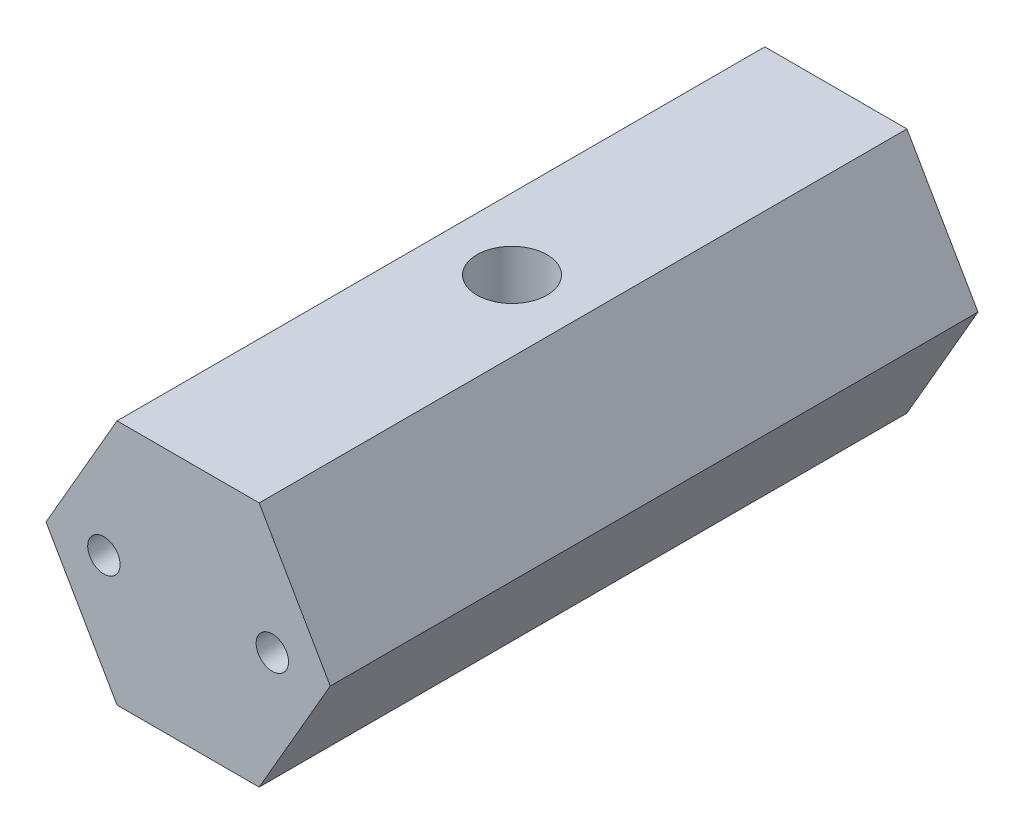
ISO-10303-21;
HEADER;
FILE_DESCRIPTION(('STEP AP214'),'2;1');
FILE_NAME('part.step','',(''),(''),'','','');
FILE_SCHEMA(('AUTOMOTIVE_DESIGN { 1 0 10303 214 1 1 1 1 }'));
ENDSEC;
DATA;
#1=APPLICATION_CONTEXT('core data for automotive mechanical design processes');
#2=APPLICATION_PROTOCOL_DEFINITION('international standard','automotive_design',2000,#1);
#3=PRODUCT_CONTEXT('',#1,'mechanical');
#4=PRODUCT('Part','Part','',(#3));
#5=PRODUCT_RELATED_PRODUCT_CATEGORY('part','',(#4));
#6=PRODUCT_DEFINITION_FORMATION('','',#4);
#7=PRODUCT_DEFINITION_CONTEXT('part definition',#1,'design');
#8=PRODUCT_DEFINITION('design','',#6,#7);
#9=PRODUCT_DEFINITION_SHAPE('','',#8);
#10=(LENGTH_UNIT() NAMED_UNIT(*) SI_UNIT(.MILLI.,.METRE.));
#11=(NAMED_UNIT(*) PLANE_ANGLE_UNIT() SI_UNIT($,.RADIAN.));
#12=(NAMED_UNIT(*) SI_UNIT($,.STERADIAN.) SOLID_ANGLE_UNIT());
#13=UNCERTAINTY_MEASURE_WITH_UNIT(LENGTH_MEASURE(1.E-05),#10,'distance_accuracy_value','');
#14=(GEOMETRIC_REPRESENTATION_CONTEXT(3) GLOBAL_UNCERTAINTY_ASSIGNED_CONTEXT((#13)) GLOBAL_UNIT_ASSIGNED_CONTEXT((#10,
#11,#12)) REPRESENTATION_CONTEXT('',''));
#15=CARTESIAN_POINT('',(0.,0.,0.));
#16=DIRECTION('',(0.,0.,1.));
#17=DIRECTION('',(1.,0.,0.));
#18=AXIS2_PLACEMENT_3D('',#15,#16,#17);
#19=CARTESIAN_POINT('',(5.48482755730145,9.5,25.));
#20=DIRECTION('',(0.,-1.,0.));
#21=DIRECTION('',(1.,0.,0.));
#22=AXIS2_PLACEMENT_3D('',#19,#20,#21);
#23=PLANE('',#22);
#24=DIRECTION('',(-1.,0.,0.));
#25=VECTOR('',#24,1.);
#26=CARTESIAN_POINT('',(5.48482755730145,9.5,-25.));
#27=LINE('',#26,#25);
#28=CARTESIAN_POINT('',(5.48482755730145,9.5,-25.));
#29=VERTEX_POINT('',#28);
#30=CARTESIAN_POINT('',(-5.48482755730144,9.5,-25.));
#31=VERTEX_POINT('',#30);
#32=EDGE_CURVE('E93',#29,#31,#27,.T.);
#33=ORIENTED_EDGE('',*,*,#32,.T.);
#34=DIRECTION('',(0.,0.,-1.));
#35=VECTOR('',#34,1.);
#36=CARTESIAN_POINT('',(-5.48482755730144,9.5,25.));
#37=LINE('',#36,#35);
#38=CARTESIAN_POINT('',(-5.48482755730144,9.5,25.));
#39=VERTEX_POINT('',#38);
#40=EDGE_CURVE('E131',#39,#31,#37,.T.);
#41=ORIENTED_EDGE('',*,*,#40,.F.);
#42=DIRECTION('',(-1.,0.,0.));
#43=VECTOR('',#42,1.);
#44=CARTESIAN_POINT('',(5.48482755730145,9.5,25.));
#45=LINE('',#44,#43);
#46=CARTESIAN_POINT('',(5.48482755730145,9.5,25.));
#47=VERTEX_POINT('',#46);
#48=EDGE_CURVE('E119',#47,#39,#45,.T.);
#49=ORIENTED_EDGE('',*,*,#48,.F.);
#50=DIRECTION('',(0.,0.,-1.));
#51=VECTOR('',#50,1.);
#52=CARTESIAN_POINT('',(5.48482755730145,9.5,25.));
#53=LINE('',#52,#51);
#54=EDGE_CURVE('E126',#47,#29,#53,.T.);
#55=ORIENTED_EDGE('',*,*,#54,.T.);
#56=EDGE_LOOP('',(#33,#41,#49,#55));
#57=FACE_BOUND('',#56,.T.);
#58=CARTESIAN_POINT('',(0.,9.5,0.));
#59=DIRECTION('',(0.,1.,0.));
#60=DIRECTION('',(0.,0.,1.));
#61=AXIS2_PLACEMENT_3D('',#58,#59,#60);
#62=CIRCLE('',#61,2.70509999999999);
#63=CARTESIAN_POINT('',(0.,9.5,2.70509999999999));
#64=VERTEX_POINT('',#63);
#65=EDGE_CURVE('E199',#64,#64,#62,.T.);
#66=ORIENTED_EDGE('',*,*,#65,.F.);
#67=EDGE_LOOP('',(#66));
#68=FACE_BOUND('',#67,.T.);
#69=ADVANCED_FACE('F53',(#57,#68),#23,.F.);
#70=CARTESIAN_POINT('',(0.,0.,25.));
#71=DIRECTION('',(0.,0.,1.));
#72=DIRECTION('',(1.,0.,0.));
#73=AXIS2_PLACEMENT_3D('',#70,#71,#72);
#74=PLANE('',#73);
#75=CARTESIAN_POINT('',(-6.5,0.,25.));
#76=DIRECTION('',(0.,0.,1.));
#77=DIRECTION('',(1.,0.,0.));
#78=AXIS2_PLACEMENT_3D('',#75,#76,#77);
#79=CIRCLE('',#78,1.25);
#80=CARTESIAN_POINT('',(-5.25,0.,25.));
#81=VERTEX_POINT('',#80);
#82=EDGE_CURVE('E143',#81,#81,#79,.T.);
#83=ORIENTED_EDGE('',*,*,#82,.F.);
#84=EDGE_LOOP('',(#83));
#85=FACE_BOUND('',#84,.T.);
#86=DIRECTION('',(0.5,-0.866025403784438,0.));
#87=VECTOR('',#86,1.);
#88=CARTESIAN_POINT('',(-10.9696551146029,0.,25.));
#89=LINE('',#88,#87);
#90=CARTESIAN_POINT('',(-10.9696551146029,0.,25.));
#91=VERTEX_POINT('',#90);
#92=CARTESIAN_POINT('',(-5.48482755730144,-9.5,25.));
#93=VERTEX_POINT('',#92);
#94=EDGE_CURVE('E150',#91,#93,#89,.T.);
#95=ORIENTED_EDGE('',*,*,#94,.T.);
#96=DIRECTION('',(1.,0.,0.));
#97=VECTOR('',#96,1.);
#98=CARTESIAN_POINT('',(-5.48482755730144,-9.5,25.));
#99=LINE('',#98,#97);
#100=CARTESIAN_POINT('',(5.48482755730145,-9.5,25.));
#101=VERTEX_POINT('',#100);
#102=EDGE_CURVE('E107',#93,#101,#99,.T.);
#103=ORIENTED_EDGE('',*,*,#102,.T.);
#104=DIRECTION('',(0.5,0.866025403784439,0.));
#105=VECTOR('',#104,1.);
#106=CARTESIAN_POINT('',(5.48482755730145,-9.5,25.));
#107=LINE('',#106,#105);
#108=CARTESIAN_POINT('',(10.9696551146029,0.,25.));
#109=VERTEX_POINT('',#108);
#110=EDGE_CURVE('E121',#101,#109,#107,.T.);
#111=ORIENTED_EDGE('',*,*,#110,.T.);
#112=DIRECTION('',(-0.5,0.866025403784439,0.));
#113=VECTOR('',#112,1.);
#114=CARTESIAN_POINT('',(10.9696551146029,0.,25.));
#115=LINE('',#114,#113);
#116=EDGE_CURVE('E114',#109,#47,#115,.T.);
#117=ORIENTED_EDGE('',*,*,#116,.T.);
#118=ORIENTED_EDGE('',*,*,#48,.T.);
#119=DIRECTION('',(-0.5,-0.866025403784439,0.));
#120=VECTOR('',#119,1.);
#121=CARTESIAN_POINT('',(-5.48482755730144,9.5,25.));
#122=LINE('',#121,#120);
#123=EDGE_CURVE('E70',#39,#91,#122,.T.);
#124=ORIENTED_EDGE('',*,*,#123,.T.);
#125=EDGE_LOOP('',(#95,#103,#111,#117,#118,#124));
#126=FACE_BOUND('',#125,.T.);
#127=CARTESIAN_POINT('',(6.5,0.,25.));
#128=DIRECTION('',(0.,0.,1.));
#129=DIRECTION('',(1.,0.,0.));
#130=AXIS2_PLACEMENT_3D('',#127,#128,#129);
#131=CIRCLE('',#130,1.25);
#132=CARTESIAN_POINT('',(7.75,0.,25.));
#133=VERTEX_POINT('',#132);
#134=EDGE_CURVE('E202',#133,#133,#131,.T.);
#135=ORIENTED_EDGE('',*,*,#134,.F.);
#136=EDGE_LOOP('',(#135));
#137=FACE_BOUND('',#136,.T.);
#138=ADVANCED_FACE('F116',(#85,#126,#137),#74,.T.);
#139=CARTESIAN_POINT('',(0.,0.,-25.));
#140=DIRECTION('',(0.,0.,1.));
#141=DIRECTION('',(1.,0.,0.));
#142=AXIS2_PLACEMENT_3D('',#139,#140,#141);
#143=PLANE('',#142);
#144=DIRECTION('',(0.5,-0.866025403784438,0.));
#145=VECTOR('',#144,1.);
#146=CARTESIAN_POINT('',(-10.9696551146029,0.,-25.));
#147=LINE('',#146,#145);
#148=CARTESIAN_POINT('',(-10.9696551146029,0.,-25.));
#149=VERTEX_POINT('',#148);
#150=CARTESIAN_POINT('',(-5.48482755730144,-9.5,-25.));
#151=VERTEX_POINT('',#150);
#152=EDGE_CURVE('E139',#149,#151,#147,.T.);
#153=ORIENTED_EDGE('',*,*,#152,.F.);
#154=DIRECTION('',(-0.5,-0.866025403784439,0.));
#155=VECTOR('',#154,1.);
#156=CARTESIAN_POINT('',(-5.48482755730144,9.5,-25.));
#157=LINE('',#156,#155);
#158=EDGE_CURVE('E99',#31,#149,#157,.T.);
#159=ORIENTED_EDGE('',*,*,#158,.F.);
#160=ORIENTED_EDGE('',*,*,#32,.F.);
#161=DIRECTION('',(-0.5,0.866025403784439,0.));
#162=VECTOR('',#161,1.);
#163=CARTESIAN_POINT('',(10.9696551146029,0.,-25.));
#164=LINE('',#163,#162);
#165=CARTESIAN_POINT('',(10.9696551146029,0.,-25.));
#166=VERTEX_POINT('',#165);
#167=EDGE_CURVE('E129',#166,#29,#164,.T.);
#168=ORIENTED_EDGE('',*,*,#167,.F.);
#169=DIRECTION('',(0.5,0.866025403784439,0.));
#170=VECTOR('',#169,1.);
#171=CARTESIAN_POINT('',(5.48482755730145,-9.5,-25.));
#172=LINE('',#171,#170);
#173=CARTESIAN_POINT('',(5.48482755730145,-9.5,-25.));
#174=VERTEX_POINT('',#173);
#175=EDGE_CURVE('E145',#174,#166,#172,.T.);
#176=ORIENTED_EDGE('',*,*,#175,.F.);
#177=DIRECTION('',(1.,0.,0.));
#178=VECTOR('',#177,1.);
#179=CARTESIAN_POINT('',(-5.48482755730144,-9.5,-25.));
#180=LINE('',#179,#178);
#181=EDGE_CURVE('E142',#151,#174,#180,.T.);
#182=ORIENTED_EDGE('',*,*,#181,.F.);
#183=EDGE_LOOP('',(#153,#159,#160,#168,#176,#182));
#184=FACE_BOUND('',#183,.T.);
#185=CARTESIAN_POINT('',(-6.5,0.,-25.));
#186=DIRECTION('',(0.,0.,1.));
#187=DIRECTION('',(1.,0.,0.));
#188=AXIS2_PLACEMENT_3D('',#185,#186,#187);
#189=CIRCLE('',#188,1.25);
#190=CARTESIAN_POINT('',(-5.25,0.,-25.));
#191=VERTEX_POINT('',#190);
#192=EDGE_CURVE('E208',#191,#191,#189,.T.);
#193=ORIENTED_EDGE('',*,*,#192,.T.);
#194=EDGE_LOOP('',(#193));
#195=FACE_BOUND('',#194,.T.);
#196=CARTESIAN_POINT('',(6.5,0.,-25.));
#197=DIRECTION('',(0.,0.,1.));
#198=DIRECTION('',(1.,0.,0.));
#199=AXIS2_PLACEMENT_3D('',#196,#197,#198);
#200=CIRCLE('',#199,1.25);
#201=CARTESIAN_POINT('',(7.75,0.,-25.));
#202=VERTEX_POINT('',#201);
#203=EDGE_CURVE('E198',#202,#202,#200,.T.);
#204=ORIENTED_EDGE('',*,*,#203,.T.);
#205=EDGE_LOOP('',(#204));
#206=FACE_BOUND('',#205,.T.);
#207=ADVANCED_FACE('F159',(#184,#195,#206),#143,.F.);
#208=CARTESIAN_POINT('',(-10.9696551146029,0.,25.));
#209=DIRECTION('',(0.866025403784438,0.5,0.));
#210=DIRECTION('',(-0.5,0.866025403784439,0.));
#211=AXIS2_PLACEMENT_3D('',#208,#209,#210);
#212=PLANE('',#211);
#213=ORIENTED_EDGE('',*,*,#152,.T.);
#214=DIRECTION('',(0.,0.,-1.));
#215=VECTOR('',#214,1.);
#216=CARTESIAN_POINT('',(-5.48482755730144,-9.5,25.));
#217=LINE('',#216,#215);
#218=EDGE_CURVE('E11',#93,#151,#217,.T.);
#219=ORIENTED_EDGE('',*,*,#218,.F.);
#220=ORIENTED_EDGE('',*,*,#94,.F.);
#221=DIRECTION('',(0.,0.,-1.));
#222=VECTOR('',#221,1.);
#223=CARTESIAN_POINT('',(-10.9696551146029,0.,25.));
#224=LINE('',#223,#222);
#225=EDGE_CURVE('E135',#91,#149,#224,.T.);
#226=ORIENTED_EDGE('',*,*,#225,.T.);
#227=EDGE_LOOP('',(#213,#219,#220,#226));
#228=FACE_BOUND('',#227,.T.);
#229=ADVANCED_FACE('F55',(#228),#212,.F.);
#230=CARTESIAN_POINT('',(-5.48482755730144,-9.5,25.));
#231=DIRECTION('',(0.,1.,0.));
#232=DIRECTION('',(-1.,0.,0.));
#233=AXIS2_PLACEMENT_3D('',#230,#231,#232);
#234=PLANE('',#233);
#235=CARTESIAN_POINT('',(0.,-9.5,0.));
#236=DIRECTION('',(0.,1.,0.));
#237=DIRECTION('',(-1.,0.,0.));
#238=AXIS2_PLACEMENT_3D('',#235,#236,#237);
#239=CIRCLE('',#238,2.70509999999999);
#240=CARTESIAN_POINT('',(-2.70509999999999,-9.5,0.));
#241=VERTEX_POINT('',#240);
#242=EDGE_CURVE('E196',#241,#241,#239,.T.);
#243=ORIENTED_EDGE('',*,*,#242,.T.);
#244=EDGE_LOOP('',(#243));
#245=FACE_BOUND('',#244,.T.);
#246=ORIENTED_EDGE('',*,*,#181,.T.);
#247=DIRECTION('',(0.,0.,-1.));
#248=VECTOR('',#247,1.);
#249=CARTESIAN_POINT('',(5.48482755730145,-9.5,25.));
#250=LINE('',#249,#248);
#251=EDGE_CURVE('E62',#101,#174,#250,.T.);
#252=ORIENTED_EDGE('',*,*,#251,.F.);
#253=ORIENTED_EDGE('',*,*,#102,.F.);
#254=ORIENTED_EDGE('',*,*,#218,.T.);
#255=EDGE_LOOP('',(#246,#252,#253,#254));
#256=FACE_BOUND('',#255,.T.);
#257=ADVANCED_FACE('F187',(#245,#256),#234,.F.);
#258=CARTESIAN_POINT('',(5.48482755730145,-9.5,25.));
#259=DIRECTION('',(-0.866025403784439,0.5,0.));
#260=DIRECTION('',(-0.5,-0.866025403784439,0.));
#261=AXIS2_PLACEMENT_3D('',#258,#259,#260);
#262=PLANE('',#261);
#263=ORIENTED_EDGE('',*,*,#175,.T.);
#264=DIRECTION('',(0.,0.,-1.));
#265=VECTOR('',#264,1.);
#266=CARTESIAN_POINT('',(10.9696551146029,0.,25.));
#267=LINE('',#266,#265);
#268=EDGE_CURVE('E130',#109,#166,#267,.T.);
#269=ORIENTED_EDGE('',*,*,#268,.F.);
#270=ORIENTED_EDGE('',*,*,#110,.F.);
#271=ORIENTED_EDGE('',*,*,#251,.T.);
#272=EDGE_LOOP('',(#263,#269,#270,#271));
#273=FACE_BOUND('',#272,.T.);
#274=ADVANCED_FACE('F156',(#273),#262,.F.);
#275=CARTESIAN_POINT('',(10.9696551146029,0.,25.));
#276=DIRECTION('',(-0.866025403784439,-0.5,0.));
#277=DIRECTION('',(0.5,-0.866025403784439,0.));
#278=AXIS2_PLACEMENT_3D('',#275,#276,#277);
#279=PLANE('',#278);
#280=ORIENTED_EDGE('',*,*,#167,.T.);
#281=ORIENTED_EDGE('',*,*,#54,.F.);
#282=ORIENTED_EDGE('',*,*,#116,.F.);
#283=ORIENTED_EDGE('',*,*,#268,.T.);
#284=EDGE_LOOP('',(#280,#281,#282,#283));
#285=FACE_BOUND('',#284,.T.);
#286=ADVANCED_FACE('F127',(#285),#279,.F.);
#287=CARTESIAN_POINT('',(-5.48482755730144,9.5,25.));
#288=DIRECTION('',(0.866025403784439,-0.5,0.));
#289=DIRECTION('',(0.5,0.866025403784439,0.));
#290=AXIS2_PLACEMENT_3D('',#287,#288,#289);
#291=PLANE('',#290);
#292=ORIENTED_EDGE('',*,*,#158,.T.);
#293=ORIENTED_EDGE('',*,*,#225,.F.);
#294=ORIENTED_EDGE('',*,*,#123,.F.);
#295=ORIENTED_EDGE('',*,*,#40,.T.);
#296=EDGE_LOOP('',(#292,#293,#294,#295));
#297=FACE_BOUND('',#296,.T.);
#298=ADVANCED_FACE('F164',(#297),#291,.F.);
#299=CARTESIAN_POINT('',(-6.5,0.,25.));
#300=DIRECTION('',(0.,0.,-1.));
#301=DIRECTION('',(-1.,0.,0.));
#302=AXIS2_PLACEMENT_3D('',#299,#300,#301);
#303=CYLINDRICAL_SURFACE('',#302,1.25);
#304=ORIENTED_EDGE('',*,*,#82,.T.);
#305=EDGE_LOOP('',(#304));
#306=FACE_BOUND('',#305,.T.);
#307=ORIENTED_EDGE('',*,*,#192,.F.);
#308=EDGE_LOOP('',(#307));
#309=FACE_BOUND('',#308,.T.);
#310=ADVANCED_FACE('F166',(#306,#309),#303,.F.);
#311=CARTESIAN_POINT('',(6.5,0.,25.));
#312=DIRECTION('',(0.,0.,-1.));
#313=DIRECTION('',(-1.,0.,0.));
#314=AXIS2_PLACEMENT_3D('',#311,#312,#313);
#315=CYLINDRICAL_SURFACE('',#314,1.25);
#316=ORIENTED_EDGE('',*,*,#134,.T.);
#317=EDGE_LOOP('',(#316));
#318=FACE_BOUND('',#317,.T.);
#319=ORIENTED_EDGE('',*,*,#203,.F.);
#320=EDGE_LOOP('',(#319));
#321=FACE_BOUND('',#320,.T.);
#322=ADVANCED_FACE('F172',(#318,#321),#315,.F.);
#323=CARTESIAN_POINT('',(0.,9.5,0.));
#324=DIRECTION('',(0.,1.,0.));
#325=DIRECTION('',(0.,0.,1.));
#326=AXIS2_PLACEMENT_3D('',#323,#324,#325);
#327=CYLINDRICAL_SURFACE('',#326,2.70509999999999);
#328=ORIENTED_EDGE('',*,*,#242,.F.);
#329=EDGE_LOOP('',(#328));
#330=FACE_BOUND('',#329,.T.);
#331=ORIENTED_EDGE('',*,*,#65,.T.);
#332=EDGE_LOOP('',(#331));
#333=FACE_BOUND('',#332,.T.);
#334=ADVANCED_FACE('F222',(#330,#333),#327,.F.);
#335=CLOSED_SHELL('',(#69,#138,#207,#229,#257,#274,#286,#298,#310,#322,#334));
#336=MANIFOLD_SOLID_BREP('B2',#335);
#337=ADVANCED_BREP_SHAPE_REPRESENTATION('',(#18,#336),#14);
#338=SHAPE_DEFINITION_REPRESENTATION(#9,#337);
ENDSEC;
END-ISO-10303-21;
